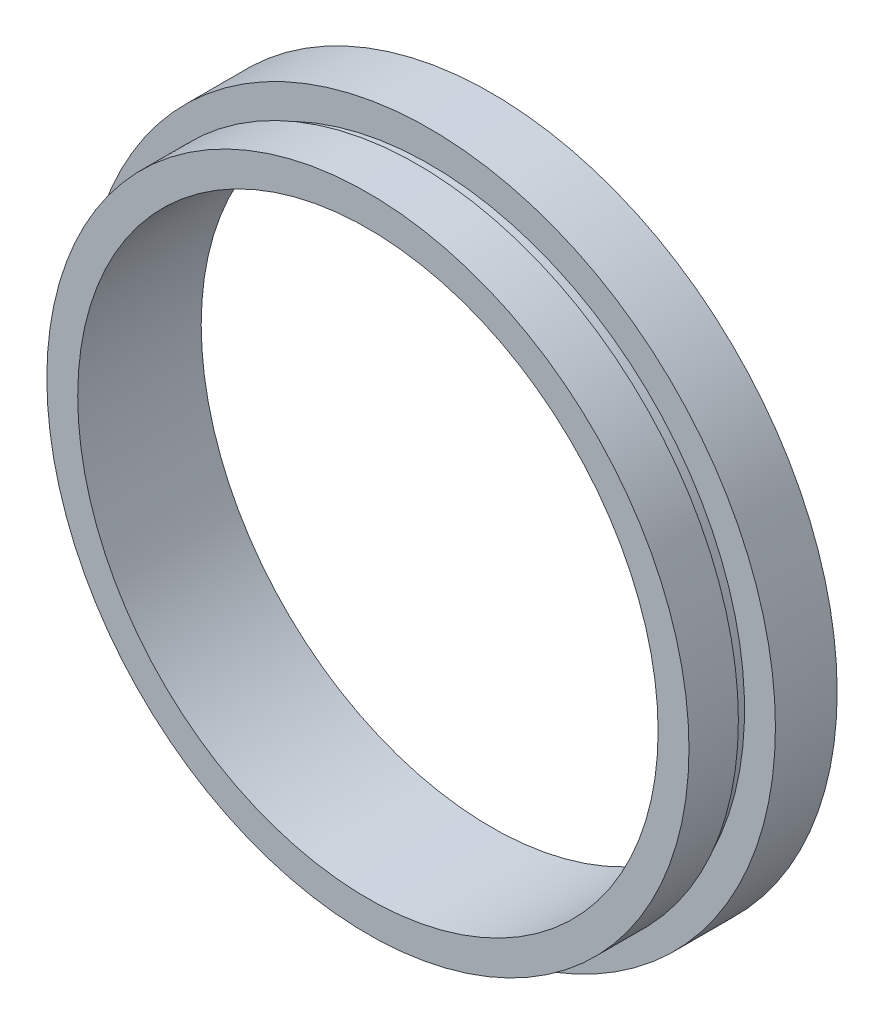
ISO-10303-21;
HEADER;
FILE_DESCRIPTION(('STEP AP214'),'2;1');
FILE_NAME('part.step','',(''),(''),'','','');
FILE_SCHEMA(('AUTOMOTIVE_DESIGN { 1 0 10303 214 1 1 1 1 }'));
ENDSEC;
DATA;
#1=APPLICATION_CONTEXT('core data for automotive mechanical design processes');
#2=APPLICATION_PROTOCOL_DEFINITION('international standard','automotive_design',2000,#1);
#3=PRODUCT_CONTEXT('',#1,'mechanical');
#4=PRODUCT('Part','Part','',(#3));
#5=PRODUCT_RELATED_PRODUCT_CATEGORY('part','',(#4));
#6=PRODUCT_DEFINITION_FORMATION('','',#4);
#7=PRODUCT_DEFINITION_CONTEXT('part definition',#1,'design');
#8=PRODUCT_DEFINITION('design','',#6,#7);
#9=PRODUCT_DEFINITION_SHAPE('','',#8);
#10=(LENGTH_UNIT() NAMED_UNIT(*) SI_UNIT(.MILLI.,.METRE.));
#11=(NAMED_UNIT(*) PLANE_ANGLE_UNIT() SI_UNIT($,.RADIAN.));
#12=(NAMED_UNIT(*) SI_UNIT($,.STERADIAN.) SOLID_ANGLE_UNIT());
#13=UNCERTAINTY_MEASURE_WITH_UNIT(LENGTH_MEASURE(1.E-05),#10,'distance_accuracy_value','');
#14=(GEOMETRIC_REPRESENTATION_CONTEXT(3) GLOBAL_UNCERTAINTY_ASSIGNED_CONTEXT((#13)) GLOBAL_UNIT_ASSIGNED_CONTEXT((#10,
#11,#12)) REPRESENTATION_CONTEXT('',''));
#15=CARTESIAN_POINT('',(0.,0.,0.));
#16=DIRECTION('',(0.,0.,1.));
#17=DIRECTION('',(1.,0.,0.));
#18=AXIS2_PLACEMENT_3D('',#15,#16,#17);
#19=CARTESIAN_POINT('',(23.5,0.,0.));
#20=DIRECTION('',(0.,0.,-1.));
#21=DIRECTION('',(-1.,0.,0.));
#22=AXIS2_PLACEMENT_3D('',#19,#20,#21);
#23=PLANE('',#22);
#24=CARTESIAN_POINT('',(0.,0.,0.));
#25=DIRECTION('',(0.,0.,-1.));
#26=DIRECTION('',(-1.,0.,0.));
#27=AXIS2_PLACEMENT_3D('',#24,#25,#26);
#28=CIRCLE('',#27,26.);
#29=CARTESIAN_POINT('',(-26.,0.,0.));
#30=VERTEX_POINT('',#29);
#31=EDGE_CURVE('E10',#30,#30,#28,.T.);
#32=ORIENTED_EDGE('',*,*,#31,.F.);
#33=EDGE_LOOP('',(#32));
#34=FACE_BOUND('',#33,.T.);
#35=CARTESIAN_POINT('',(0.,0.,0.));
#36=DIRECTION('',(0.,0.,-1.));
#37=DIRECTION('',(-1.,0.,0.));
#38=AXIS2_PLACEMENT_3D('',#35,#36,#37);
#39=CIRCLE('',#38,23.5);
#40=CARTESIAN_POINT('',(-23.5,0.,0.));
#41=VERTEX_POINT('',#40);
#42=EDGE_CURVE('E63',#41,#41,#39,.T.);
#43=ORIENTED_EDGE('',*,*,#42,.T.);
#44=EDGE_LOOP('',(#43));
#45=FACE_BOUND('',#44,.T.);
#46=ADVANCED_FACE('F35',(#34,#45),#23,.F.);
#47=CARTESIAN_POINT('',(0.,0.,-19.1405797101449));
#48=DIRECTION('',(0.,0.,-1.));
#49=DIRECTION('',(-1.,0.,0.));
#50=AXIS2_PLACEMENT_3D('',#47,#48,#49);
#51=CYLINDRICAL_SURFACE('',#50,26.);
#52=CARTESIAN_POINT('',(0.,0.,-4.));
#53=DIRECTION('',(0.,0.,-1.));
#54=DIRECTION('',(-1.,0.,0.));
#55=AXIS2_PLACEMENT_3D('',#52,#53,#54);
#56=CIRCLE('',#55,26.);
#57=CARTESIAN_POINT('',(-26.,0.,-4.));
#58=VERTEX_POINT('',#57);
#59=EDGE_CURVE('E41',#58,#58,#56,.T.);
#60=ORIENTED_EDGE('',*,*,#59,.F.);
#61=EDGE_LOOP('',(#60));
#62=FACE_BOUND('',#61,.T.);
#63=ORIENTED_EDGE('',*,*,#31,.T.);
#64=EDGE_LOOP('',(#63));
#65=FACE_BOUND('',#64,.T.);
#66=ADVANCED_FACE('F100',(#62,#65),#51,.T.);
#67=CARTESIAN_POINT('',(26.,0.,-4.));
#68=DIRECTION('',(0.,0.,1.));
#69=DIRECTION('',(1.,0.,0.));
#70=AXIS2_PLACEMENT_3D('',#67,#68,#69);
#71=PLANE('',#70);
#72=CARTESIAN_POINT('',(0.,0.,-4.));
#73=DIRECTION('',(0.,0.,-1.));
#74=DIRECTION('',(-1.,0.,0.));
#75=AXIS2_PLACEMENT_3D('',#72,#73,#74);
#76=CIRCLE('',#75,25.5);
#77=CARTESIAN_POINT('',(-25.5,0.,-4.));
#78=VERTEX_POINT('',#77);
#79=EDGE_CURVE('E45',#78,#78,#76,.T.);
#80=ORIENTED_EDGE('',*,*,#79,.F.);
#81=EDGE_LOOP('',(#80));
#82=FACE_BOUND('',#81,.T.);
#83=ORIENTED_EDGE('',*,*,#59,.T.);
#84=EDGE_LOOP('',(#83));
#85=FACE_BOUND('',#84,.T.);
#86=ADVANCED_FACE('F95',(#82,#85),#71,.F.);
#87=CARTESIAN_POINT('',(0.,0.,-19.1405797101449));
#88=DIRECTION('',(0.,0.,-1.));
#89=DIRECTION('',(-1.,0.,0.));
#90=AXIS2_PLACEMENT_3D('',#87,#88,#89);
#91=CYLINDRICAL_SURFACE('',#90,25.5);
#92=CARTESIAN_POINT('',(0.,0.,-5.));
#93=DIRECTION('',(0.,0.,-1.));
#94=DIRECTION('',(-1.,0.,0.));
#95=AXIS2_PLACEMENT_3D('',#92,#93,#94);
#96=CIRCLE('',#95,25.5);
#97=CARTESIAN_POINT('',(-25.5,0.,-5.));
#98=VERTEX_POINT('',#97);
#99=EDGE_CURVE('E49',#98,#98,#96,.T.);
#100=ORIENTED_EDGE('',*,*,#99,.F.);
#101=EDGE_LOOP('',(#100));
#102=FACE_BOUND('',#101,.T.);
#103=ORIENTED_EDGE('',*,*,#79,.T.);
#104=EDGE_LOOP('',(#103));
#105=FACE_BOUND('',#104,.T.);
#106=ADVANCED_FACE('F89',(#102,#105),#91,.T.);
#107=CARTESIAN_POINT('',(25.5,0.,-5.));
#108=DIRECTION('',(0.,0.,-1.));
#109=DIRECTION('',(-1.,0.,0.));
#110=AXIS2_PLACEMENT_3D('',#107,#108,#109);
#111=PLANE('',#110);
#112=CARTESIAN_POINT('',(0.,0.,-5.));
#113=DIRECTION('',(0.,0.,-1.));
#114=DIRECTION('',(-1.,0.,0.));
#115=AXIS2_PLACEMENT_3D('',#112,#113,#114);
#116=CIRCLE('',#115,28.);
#117=CARTESIAN_POINT('',(-28.,0.,-5.));
#118=VERTEX_POINT('',#117);
#119=EDGE_CURVE('E54',#118,#118,#116,.T.);
#120=ORIENTED_EDGE('',*,*,#119,.F.);
#121=EDGE_LOOP('',(#120));
#122=FACE_BOUND('',#121,.T.);
#123=ORIENTED_EDGE('',*,*,#99,.T.);
#124=EDGE_LOOP('',(#123));
#125=FACE_BOUND('',#124,.T.);
#126=ADVANCED_FACE('F83',(#122,#125),#111,.F.);
#127=CARTESIAN_POINT('',(0.,0.,-19.1405797101449));
#128=DIRECTION('',(0.,0.,-1.));
#129=DIRECTION('',(-1.,0.,0.));
#130=AXIS2_PLACEMENT_3D('',#127,#128,#129);
#131=CYLINDRICAL_SURFACE('',#130,28.);
#132=CARTESIAN_POINT('',(0.,0.,-10.));
#133=DIRECTION('',(0.,0.,-1.));
#134=DIRECTION('',(-1.,0.,0.));
#135=AXIS2_PLACEMENT_3D('',#132,#133,#134);
#136=CIRCLE('',#135,28.);
#137=CARTESIAN_POINT('',(-28.,0.,-10.));
#138=VERTEX_POINT('',#137);
#139=EDGE_CURVE('E57',#138,#138,#136,.T.);
#140=ORIENTED_EDGE('',*,*,#139,.F.);
#141=EDGE_LOOP('',(#140));
#142=FACE_BOUND('',#141,.T.);
#143=ORIENTED_EDGE('',*,*,#119,.T.);
#144=EDGE_LOOP('',(#143));
#145=FACE_BOUND('',#144,.T.);
#146=ADVANCED_FACE('F77',(#142,#145),#131,.T.);
#147=CARTESIAN_POINT('',(28.,0.,-10.));
#148=DIRECTION('',(0.,0.,1.));
#149=DIRECTION('',(1.,0.,0.));
#150=AXIS2_PLACEMENT_3D('',#147,#148,#149);
#151=PLANE('',#150);
#152=CARTESIAN_POINT('',(0.,0.,-10.));
#153=DIRECTION('',(0.,0.,-1.));
#154=DIRECTION('',(-1.,0.,0.));
#155=AXIS2_PLACEMENT_3D('',#152,#153,#154);
#156=CIRCLE('',#155,23.5);
#157=CARTESIAN_POINT('',(-23.5,0.,-10.));
#158=VERTEX_POINT('',#157);
#159=EDGE_CURVE('E60',#158,#158,#156,.T.);
#160=ORIENTED_EDGE('',*,*,#159,.F.);
#161=EDGE_LOOP('',(#160));
#162=FACE_BOUND('',#161,.T.);
#163=ORIENTED_EDGE('',*,*,#139,.T.);
#164=EDGE_LOOP('',(#163));
#165=FACE_BOUND('',#164,.T.);
#166=ADVANCED_FACE('F71',(#162,#165),#151,.F.);
#167=CARTESIAN_POINT('',(0.,0.,-19.1405797101449));
#168=DIRECTION('',(0.,0.,-1.));
#169=DIRECTION('',(-1.,0.,0.));
#170=AXIS2_PLACEMENT_3D('',#167,#168,#169);
#171=CYLINDRICAL_SURFACE('',#170,23.5);
#172=ORIENTED_EDGE('',*,*,#42,.F.);
#173=EDGE_LOOP('',(#172));
#174=FACE_BOUND('',#173,.T.);
#175=ORIENTED_EDGE('',*,*,#159,.T.);
#176=EDGE_LOOP('',(#175));
#177=FACE_BOUND('',#176,.T.);
#178=ADVANCED_FACE('F68',(#174,#177),#171,.F.);
#179=CLOSED_SHELL('',(#46,#66,#86,#106,#126,#146,#166,#178));
#180=MANIFOLD_SOLID_BREP('B2',#179);
#181=ADVANCED_BREP_SHAPE_REPRESENTATION('',(#18,#180),#14);
#182=SHAPE_DEFINITION_REPRESENTATION(#9,#181);
ENDSEC;
END-ISO-10303-21;
